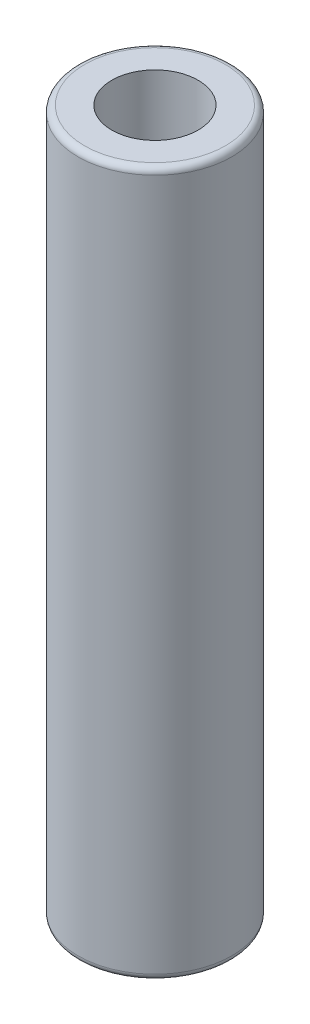
ISO-10303-21;
HEADER;
FILE_DESCRIPTION(('STEP AP214'),'2;1');
FILE_NAME('part.step','',(''),(''),'','','');
FILE_SCHEMA(('AUTOMOTIVE_DESIGN { 1 0 10303 214 1 1 1 1 }'));
ENDSEC;
DATA;
#1=APPLICATION_CONTEXT('core data for automotive mechanical design processes');
#2=APPLICATION_PROTOCOL_DEFINITION('international standard','automotive_design',2000,#1);
#3=PRODUCT_CONTEXT('',#1,'mechanical');
#4=PRODUCT('Part','Part','',(#3));
#5=PRODUCT_RELATED_PRODUCT_CATEGORY('part','',(#4));
#6=PRODUCT_DEFINITION_FORMATION('','',#4);
#7=PRODUCT_DEFINITION_CONTEXT('part definition',#1,'design');
#8=PRODUCT_DEFINITION('design','',#6,#7);
#9=PRODUCT_DEFINITION_SHAPE('','',#8);
#10=(LENGTH_UNIT() NAMED_UNIT(*) SI_UNIT(.MILLI.,.METRE.));
#11=(NAMED_UNIT(*) PLANE_ANGLE_UNIT() SI_UNIT($,.RADIAN.));
#12=(NAMED_UNIT(*) SI_UNIT($,.STERADIAN.) SOLID_ANGLE_UNIT());
#13=UNCERTAINTY_MEASURE_WITH_UNIT(LENGTH_MEASURE(1.E-05),#10,'distance_accuracy_value','');
#14=(GEOMETRIC_REPRESENTATION_CONTEXT(3) GLOBAL_UNCERTAINTY_ASSIGNED_CONTEXT((#13)) GLOBAL_UNIT_ASSIGNED_CONTEXT((#10,
#11,#12)) REPRESENTATION_CONTEXT('',''));
#15=CARTESIAN_POINT('',(0.,0.,0.));
#16=DIRECTION('',(0.,0.,1.));
#17=DIRECTION('',(1.,0.,0.));
#18=AXIS2_PLACEMENT_3D('',#15,#16,#17);
#19=CARTESIAN_POINT('',(0.,543.005217440871,0.));
#20=DIRECTION('',(0.,1.,0.));
#21=DIRECTION('',(0.,0.,1.));
#22=AXIS2_PLACEMENT_3D('',#19,#20,#21);
#23=CYLINDRICAL_SURFACE('',#22,9.52500000000006);
#24=CARTESIAN_POINT('',(0.,42.88155,0.));
#25=DIRECTION('',(0.,1.,0.));
#26=DIRECTION('',(0.,0.,1.));
#27=AXIS2_PLACEMENT_3D('',#24,#25,#26);
#28=CIRCLE('',#27,9.52500000000006);
#29=CARTESIAN_POINT('',(0.,42.88155,9.52500000000006));
#30=VERTEX_POINT('',#29);
#31=EDGE_CURVE('E11',#30,#30,#28,.T.);
#32=ORIENTED_EDGE('',*,*,#31,.F.);
#33=EDGE_LOOP('',(#32));
#34=FACE_BOUND('',#33,.T.);
#35=CARTESIAN_POINT('',(0.,-42.88155,0.));
#36=DIRECTION('',(0.,1.,0.));
#37=DIRECTION('',(0.,0.,1.));
#38=AXIS2_PLACEMENT_3D('',#35,#36,#37);
#39=CIRCLE('',#38,9.52500000000006);
#40=CARTESIAN_POINT('',(0.,-42.88155,9.52500000000006));
#41=VERTEX_POINT('',#40);
#42=EDGE_CURVE('E64',#41,#41,#39,.T.);
#43=ORIENTED_EDGE('',*,*,#42,.T.);
#44=EDGE_LOOP('',(#43));
#45=FACE_BOUND('',#44,.T.);
#46=ADVANCED_FACE('F37',(#34,#45),#23,.T.);
#47=CARTESIAN_POINT('',(0.,42.88155,0.));
#48=DIRECTION('',(0.,1.,0.));
#49=DIRECTION('',(0.,0.,1.));
#50=AXIS2_PLACEMENT_3D('',#47,#48,#49);
#51=TOROIDAL_SURFACE('',#50,8.73125000000006,0.793750000000001);
#52=CARTESIAN_POINT('',(0.,43.6753,0.));
#53=DIRECTION('',(0.,1.,0.));
#54=DIRECTION('',(0.,0.,1.));
#55=AXIS2_PLACEMENT_3D('',#52,#53,#54);
#56=CIRCLE('',#55,8.73125000000005);
#57=CARTESIAN_POINT('',(0.,43.6753,8.73125000000005));
#58=VERTEX_POINT('',#57);
#59=EDGE_CURVE('E44',#58,#58,#56,.T.);
#60=ORIENTED_EDGE('',*,*,#59,.F.);
#61=EDGE_LOOP('',(#60));
#62=FACE_BOUND('',#61,.T.);
#63=ORIENTED_EDGE('',*,*,#31,.T.);
#64=EDGE_LOOP('',(#63));
#65=FACE_BOUND('',#64,.T.);
#66=ADVANCED_FACE('F81',(#62,#65),#51,.T.);
#67=CARTESIAN_POINT('',(0.,43.6753,0.));
#68=DIRECTION('',(0.,-1.,0.));
#69=DIRECTION('',(0.,0.,-1.));
#70=AXIS2_PLACEMENT_3D('',#67,#68,#69);
#71=PLANE('',#70);
#72=CARTESIAN_POINT('',(0.,43.6753,0.));
#73=DIRECTION('',(0.,1.,0.));
#74=DIRECTION('',(0.,0.,1.));
#75=AXIS2_PLACEMENT_3D('',#72,#73,#74);
#76=CIRCLE('',#75,5.35812999999999);
#77=CARTESIAN_POINT('',(0.,43.6753,5.35812999999999));
#78=VERTEX_POINT('',#77);
#79=EDGE_CURVE('E71',#78,#78,#76,.T.);
#80=ORIENTED_EDGE('',*,*,#79,.F.);
#81=EDGE_LOOP('',(#80));
#82=FACE_BOUND('',#81,.T.);
#83=ORIENTED_EDGE('',*,*,#59,.T.);
#84=EDGE_LOOP('',(#83));
#85=FACE_BOUND('',#84,.T.);
#86=ADVANCED_FACE('F79',(#82,#85),#71,.F.);
#87=CARTESIAN_POINT('',(0.,24.6253,0.));
#88=DIRECTION('',(0.,1.,0.));
#89=DIRECTION('',(0.,0.,1.));
#90=AXIS2_PLACEMENT_3D('',#87,#88,#89);
#91=CONICAL_SURFACE('',#90,5.35812999999999,1.02974425867665);
#92=CARTESIAN_POINT('',(0.,21.4058106913699,0.));
#93=VERTEX_POINT('',#92);
#94=VERTEX_LOOP('',#93);
#95=FACE_BOUND('',#94,.T.);
#96=CARTESIAN_POINT('',(0.,24.6253,0.));
#97=DIRECTION('',(0.,1.,0.));
#98=DIRECTION('',(0.,0.,1.));
#99=AXIS2_PLACEMENT_3D('',#96,#97,#98);
#100=CIRCLE('',#99,5.35812999999999);
#101=CARTESIAN_POINT('',(0.,24.6253,5.35812999999999));
#102=VERTEX_POINT('',#101);
#103=EDGE_CURVE('E74',#102,#102,#100,.T.);
#104=ORIENTED_EDGE('',*,*,#103,.T.);
#105=EDGE_LOOP('',(#104));
#106=FACE_BOUND('',#105,.T.);
#107=ADVANCED_FACE('F101',(#95,#106),#91,.F.);
#108=CARTESIAN_POINT('',(0.,43.6753,0.));
#109=DIRECTION('',(0.,1.,0.));
#110=DIRECTION('',(0.,0.,1.));
#111=AXIS2_PLACEMENT_3D('',#108,#109,#110);
#112=CYLINDRICAL_SURFACE('',#111,5.35812999999999);
#113=ORIENTED_EDGE('',*,*,#103,.F.);
#114=EDGE_LOOP('',(#113));
#115=FACE_BOUND('',#114,.T.);
#116=ORIENTED_EDGE('',*,*,#79,.T.);
#117=EDGE_LOOP('',(#116));
#118=FACE_BOUND('',#117,.T.);
#119=ADVANCED_FACE('F92',(#115,#118),#112,.F.);
#120=CARTESIAN_POINT('',(0.,-42.88155,0.));
#121=DIRECTION('',(0.,-1.,0.));
#122=DIRECTION('',(0.,0.,1.));
#123=AXIS2_PLACEMENT_3D('',#120,#121,#122);
#124=TOROIDAL_SURFACE('',#123,8.73125000000006,0.793750000000001);
#125=CARTESIAN_POINT('',(0.,-43.6753,0.));
#126=DIRECTION('',(0.,1.,0.));
#127=DIRECTION('',(0.,0.,1.));
#128=AXIS2_PLACEMENT_3D('',#125,#126,#127);
#129=CIRCLE('',#128,8.73125000000005);
#130=CARTESIAN_POINT('',(0.,-43.6753,8.73125000000005));
#131=VERTEX_POINT('',#130);
#132=EDGE_CURVE('E60',#131,#131,#129,.T.);
#133=ORIENTED_EDGE('',*,*,#132,.T.);
#134=EDGE_LOOP('',(#133));
#135=FACE_BOUND('',#134,.T.);
#136=ORIENTED_EDGE('',*,*,#42,.F.);
#137=EDGE_LOOP('',(#136));
#138=FACE_BOUND('',#137,.T.);
#139=ADVANCED_FACE('F90',(#135,#138),#124,.T.);
#140=CARTESIAN_POINT('',(0.,-43.6753,0.));
#141=DIRECTION('',(0.,1.,0.));
#142=DIRECTION('',(0.,0.,-1.));
#143=AXIS2_PLACEMENT_3D('',#140,#141,#142);
#144=PLANE('',#143);
#145=CARTESIAN_POINT('',(0.,-43.6753,0.));
#146=DIRECTION('',(0.,1.,0.));
#147=DIRECTION('',(0.,0.,1.));
#148=AXIS2_PLACEMENT_3D('',#145,#146,#147);
#149=CIRCLE('',#148,5.35812999999999);
#150=CARTESIAN_POINT('',(0.,-43.6753,5.35812999999999));
#151=VERTEX_POINT('',#150);
#152=EDGE_CURVE('E61',#151,#151,#149,.T.);
#153=ORIENTED_EDGE('',*,*,#152,.T.);
#154=EDGE_LOOP('',(#153));
#155=FACE_BOUND('',#154,.T.);
#156=ORIENTED_EDGE('',*,*,#132,.F.);
#157=EDGE_LOOP('',(#156));
#158=FACE_BOUND('',#157,.T.);
#159=ADVANCED_FACE('F54',(#155,#158),#144,.F.);
#160=CARTESIAN_POINT('',(0.,-24.6253,0.));
#161=DIRECTION('',(0.,-1.,0.));
#162=DIRECTION('',(0.,0.,1.));
#163=AXIS2_PLACEMENT_3D('',#160,#161,#162);
#164=CONICAL_SURFACE('',#163,5.35812999999999,1.02974425867665);
#165=CARTESIAN_POINT('',(0.,-21.4058106913699,0.));
#166=VERTEX_POINT('',#165);
#167=VERTEX_LOOP('',#166);
#168=FACE_BOUND('',#167,.T.);
#169=CARTESIAN_POINT('',(0.,-24.6253,0.));
#170=DIRECTION('',(0.,1.,0.));
#171=DIRECTION('',(0.,0.,1.));
#172=AXIS2_PLACEMENT_3D('',#169,#170,#171);
#173=CIRCLE('',#172,5.35812999999999);
#174=CARTESIAN_POINT('',(0.,-24.6253,5.35812999999999));
#175=VERTEX_POINT('',#174);
#176=EDGE_CURVE('E58',#175,#175,#173,.T.);
#177=ORIENTED_EDGE('',*,*,#176,.F.);
#178=EDGE_LOOP('',(#177));
#179=FACE_BOUND('',#178,.T.);
#180=ADVANCED_FACE('F50',(#168,#179),#164,.F.);
#181=CARTESIAN_POINT('',(0.,-43.6753,0.));
#182=DIRECTION('',(0.,-1.,0.));
#183=DIRECTION('',(0.,0.,1.));
#184=AXIS2_PLACEMENT_3D('',#181,#182,#183);
#185=CYLINDRICAL_SURFACE('',#184,5.35812999999999);
#186=ORIENTED_EDGE('',*,*,#176,.T.);
#187=EDGE_LOOP('',(#186));
#188=FACE_BOUND('',#187,.T.);
#189=ORIENTED_EDGE('',*,*,#152,.F.);
#190=EDGE_LOOP('',(#189));
#191=FACE_BOUND('',#190,.T.);
#192=ADVANCED_FACE('F53',(#188,#191),#185,.F.);
#193=CLOSED_SHELL('',(#46,#66,#86,#107,#119,#139,#159,#180,#192));
#194=MANIFOLD_SOLID_BREP('B2',#193);
#195=ADVANCED_BREP_SHAPE_REPRESENTATION('',(#18,#194),#14);
#196=SHAPE_DEFINITION_REPRESENTATION(#9,#195);
ENDSEC;
END-ISO-10303-21;
